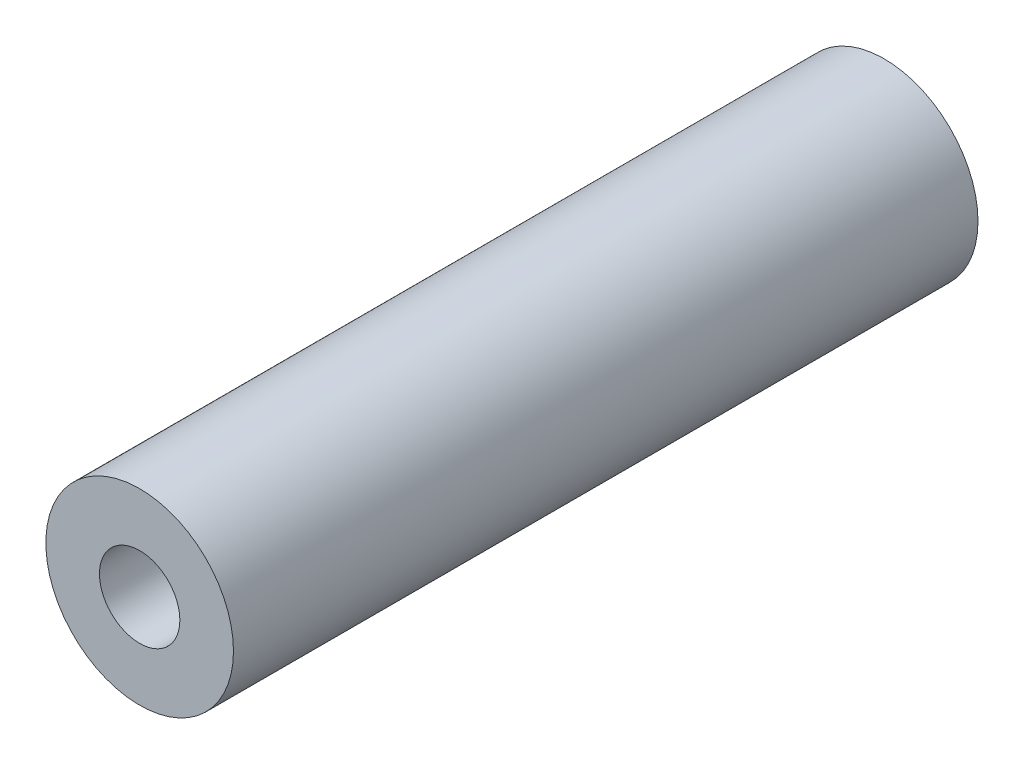
ISO-10303-21;
HEADER;
FILE_DESCRIPTION(('STEP AP214'),'2;1');
FILE_NAME('part.step','',(''),(''),'','','');
FILE_SCHEMA(('AUTOMOTIVE_DESIGN { 1 0 10303 214 1 1 1 1 }'));
ENDSEC;
DATA;
#1=APPLICATION_CONTEXT('core data for automotive mechanical design processes');
#2=APPLICATION_PROTOCOL_DEFINITION('international standard','automotive_design',2000,#1);
#3=PRODUCT_CONTEXT('',#1,'mechanical');
#4=PRODUCT('Part','Part','',(#3));
#5=PRODUCT_RELATED_PRODUCT_CATEGORY('part','',(#4));
#6=PRODUCT_DEFINITION_FORMATION('','',#4);
#7=PRODUCT_DEFINITION_CONTEXT('part definition',#1,'design');
#8=PRODUCT_DEFINITION('design','',#6,#7);
#9=PRODUCT_DEFINITION_SHAPE('','',#8);
#10=(LENGTH_UNIT() NAMED_UNIT(*) SI_UNIT(.MILLI.,.METRE.));
#11=(NAMED_UNIT(*) PLANE_ANGLE_UNIT() SI_UNIT($,.RADIAN.));
#12=(NAMED_UNIT(*) SI_UNIT($,.STERADIAN.) SOLID_ANGLE_UNIT());
#13=UNCERTAINTY_MEASURE_WITH_UNIT(LENGTH_MEASURE(1.E-05),#10,'distance_accuracy_value','');
#14=(GEOMETRIC_REPRESENTATION_CONTEXT(3) GLOBAL_UNCERTAINTY_ASSIGNED_CONTEXT((#13)) GLOBAL_UNIT_ASSIGNED_CONTEXT((#10,
#11,#12)) REPRESENTATION_CONTEXT('',''));
#15=CARTESIAN_POINT('',(0.,0.,0.));
#16=DIRECTION('',(0.,0.,1.));
#17=DIRECTION('',(1.,0.,0.));
#18=AXIS2_PLACEMENT_3D('',#15,#16,#17);
#19=CARTESIAN_POINT('',(-79.719915493535,6.14431454352392,25.4));
#20=DIRECTION('',(0.,0.,1.));
#21=DIRECTION('',(1.,0.,0.));
#22=AXIS2_PLACEMENT_3D('',#19,#20,#21);
#23=PLANE('',#22);
#24=CARTESIAN_POINT('',(-79.719915493535,6.14431454352392,25.4));
#25=DIRECTION('',(0.,0.,1.));
#26=DIRECTION('',(1.,0.,0.));
#27=AXIS2_PLACEMENT_3D('',#24,#25,#26);
#28=CIRCLE('',#27,3.2004);
#29=CARTESIAN_POINT('',(-76.519515493535,6.14431454352392,25.4));
#30=VERTEX_POINT('',#29);
#31=EDGE_CURVE('E10',#30,#30,#28,.T.);
#32=ORIENTED_EDGE('',*,*,#31,.T.);
#33=EDGE_LOOP('',(#32));
#34=FACE_BOUND('',#33,.T.);
#35=CARTESIAN_POINT('',(-79.719915493535,6.14431454352392,25.4));
#36=DIRECTION('',(0.,0.,1.));
#37=DIRECTION('',(1.,0.,0.));
#38=AXIS2_PLACEMENT_3D('',#35,#36,#37);
#39=CIRCLE('',#38,1.3716);
#40=CARTESIAN_POINT('',(-78.348315493535,6.14431454352392,25.4));
#41=VERTEX_POINT('',#40);
#42=EDGE_CURVE('E44',#41,#41,#39,.T.);
#43=ORIENTED_EDGE('',*,*,#42,.F.);
#44=EDGE_LOOP('',(#43));
#45=FACE_BOUND('',#44,.T.);
#46=ADVANCED_FACE('F33',(#34,#45),#23,.T.);
#47=CARTESIAN_POINT('',(-79.719915493535,6.14431454352392,0.));
#48=DIRECTION('',(0.,0.,1.));
#49=DIRECTION('',(1.,0.,0.));
#50=AXIS2_PLACEMENT_3D('',#47,#48,#49);
#51=PLANE('',#50);
#52=CARTESIAN_POINT('',(-79.719915493535,6.14431454352392,0.));
#53=DIRECTION('',(0.,0.,1.));
#54=DIRECTION('',(1.,0.,0.));
#55=AXIS2_PLACEMENT_3D('',#52,#53,#54);
#56=CIRCLE('',#55,3.2004);
#57=CARTESIAN_POINT('',(-76.519515493535,6.14431454352392,0.));
#58=VERTEX_POINT('',#57);
#59=EDGE_CURVE('E37',#58,#58,#56,.T.);
#60=ORIENTED_EDGE('',*,*,#59,.F.);
#61=EDGE_LOOP('',(#60));
#62=FACE_BOUND('',#61,.T.);
#63=CARTESIAN_POINT('',(-79.719915493535,6.14431454352392,0.));
#64=DIRECTION('',(0.,0.,1.));
#65=DIRECTION('',(1.,0.,0.));
#66=AXIS2_PLACEMENT_3D('',#63,#64,#65);
#67=CIRCLE('',#66,1.3716);
#68=CARTESIAN_POINT('',(-78.348315493535,6.14431454352392,0.));
#69=VERTEX_POINT('',#68);
#70=EDGE_CURVE('E46',#69,#69,#67,.T.);
#71=ORIENTED_EDGE('',*,*,#70,.T.);
#72=EDGE_LOOP('',(#71));
#73=FACE_BOUND('',#72,.T.);
#74=ADVANCED_FACE('F56',(#62,#73),#51,.F.);
#75=CARTESIAN_POINT('',(-79.719915493535,6.14431454352392,25.4));
#76=DIRECTION('',(0.,0.,-1.));
#77=DIRECTION('',(-1.,0.,0.));
#78=AXIS2_PLACEMENT_3D('',#75,#76,#77);
#79=CYLINDRICAL_SURFACE('',#78,3.2004);
#80=ORIENTED_EDGE('',*,*,#31,.F.);
#81=EDGE_LOOP('',(#80));
#82=FACE_BOUND('',#81,.T.);
#83=ORIENTED_EDGE('',*,*,#59,.T.);
#84=EDGE_LOOP('',(#83));
#85=FACE_BOUND('',#84,.T.);
#86=ADVANCED_FACE('F35',(#82,#85),#79,.T.);
#87=CARTESIAN_POINT('',(-79.719915493535,6.14431454352392,25.4));
#88=DIRECTION('',(0.,0.,-1.));
#89=DIRECTION('',(-1.,0.,0.));
#90=AXIS2_PLACEMENT_3D('',#87,#88,#89);
#91=CYLINDRICAL_SURFACE('',#90,1.3716);
#92=ORIENTED_EDGE('',*,*,#42,.T.);
#93=EDGE_LOOP('',(#92));
#94=FACE_BOUND('',#93,.T.);
#95=ORIENTED_EDGE('',*,*,#70,.F.);
#96=EDGE_LOOP('',(#95));
#97=FACE_BOUND('',#96,.T.);
#98=ADVANCED_FACE('F52',(#94,#97),#91,.F.);
#99=CLOSED_SHELL('',(#46,#74,#86,#98));
#100=MANIFOLD_SOLID_BREP('B2',#99);
#101=ADVANCED_BREP_SHAPE_REPRESENTATION('',(#18,#100),#14);
#102=SHAPE_DEFINITION_REPRESENTATION(#9,#101);
ENDSEC;
END-ISO-10303-21;
